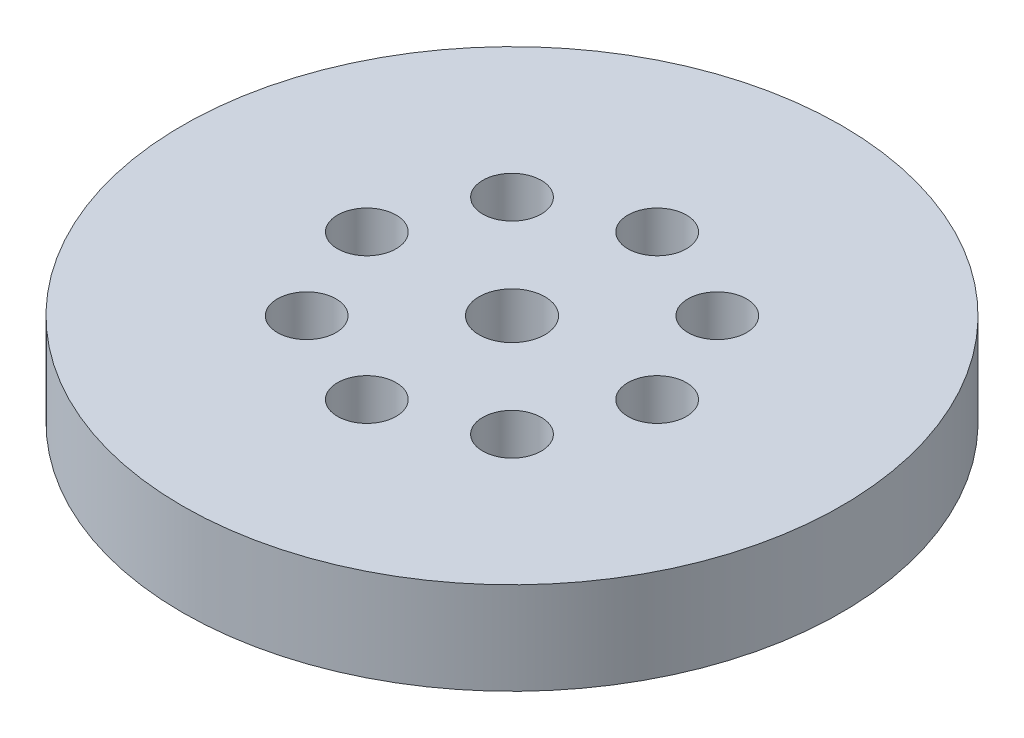
ISO-10303-21;
HEADER;
FILE_DESCRIPTION(('STEP AP214'),'2;1');
FILE_NAME('part.step','',(''),(''),'','','');
FILE_SCHEMA(('AUTOMOTIVE_DESIGN { 1 0 10303 214 1 1 1 1 }'));
ENDSEC;
DATA;
#1=APPLICATION_CONTEXT('core data for automotive mechanical design processes');
#2=APPLICATION_PROTOCOL_DEFINITION('international standard','automotive_design',2000,#1);
#3=PRODUCT_CONTEXT('',#1,'mechanical');
#4=PRODUCT('Part','Part','',(#3));
#5=PRODUCT_RELATED_PRODUCT_CATEGORY('part','',(#4));
#6=PRODUCT_DEFINITION_FORMATION('','',#4);
#7=PRODUCT_DEFINITION_CONTEXT('part definition',#1,'design');
#8=PRODUCT_DEFINITION('design','',#6,#7);
#9=PRODUCT_DEFINITION_SHAPE('','',#8);
#10=(LENGTH_UNIT() NAMED_UNIT(*) SI_UNIT(.MILLI.,.METRE.));
#11=(NAMED_UNIT(*) PLANE_ANGLE_UNIT() SI_UNIT($,.RADIAN.));
#12=(NAMED_UNIT(*) SI_UNIT($,.STERADIAN.) SOLID_ANGLE_UNIT());
#13=UNCERTAINTY_MEASURE_WITH_UNIT(LENGTH_MEASURE(1.E-05),#10,'distance_accuracy_value','');
#14=(GEOMETRIC_REPRESENTATION_CONTEXT(3) GLOBAL_UNCERTAINTY_ASSIGNED_CONTEXT((#13)) GLOBAL_UNIT_ASSIGNED_CONTEXT((#10,
#11,#12)) REPRESENTATION_CONTEXT('',''));
#15=CARTESIAN_POINT('',(0.,0.,0.));
#16=DIRECTION('',(0.,0.,1.));
#17=DIRECTION('',(1.,0.,0.));
#18=AXIS2_PLACEMENT_3D('',#15,#16,#17);
#19=CARTESIAN_POINT('',(0.,28.,0.));
#20=DIRECTION('',(0.,-1.,0.));
#21=DIRECTION('',(0.,0.,-1.));
#22=AXIS2_PLACEMENT_3D('',#19,#20,#21);
#23=CYLINDRICAL_SURFACE('',#22,100.);
#24=CARTESIAN_POINT('',(0.,28.,0.));
#25=DIRECTION('',(0.,1.,0.));
#26=DIRECTION('',(0.,0.,1.));
#27=AXIS2_PLACEMENT_3D('',#24,#25,#26);
#28=CIRCLE('',#27,100.);
#29=CARTESIAN_POINT('',(0.,28.,100.));
#30=VERTEX_POINT('',#29);
#31=EDGE_CURVE('E10',#30,#30,#28,.T.);
#32=ORIENTED_EDGE('',*,*,#31,.F.);
#33=EDGE_LOOP('',(#32));
#34=FACE_BOUND('',#33,.T.);
#35=CARTESIAN_POINT('',(0.,0.,0.));
#36=DIRECTION('',(0.,1.,0.));
#37=DIRECTION('',(0.,0.,1.));
#38=AXIS2_PLACEMENT_3D('',#35,#36,#37);
#39=CIRCLE('',#38,100.);
#40=CARTESIAN_POINT('',(0.,0.,100.));
#41=VERTEX_POINT('',#40);
#42=EDGE_CURVE('E37',#41,#41,#39,.T.);
#43=ORIENTED_EDGE('',*,*,#42,.T.);
#44=EDGE_LOOP('',(#43));
#45=FACE_BOUND('',#44,.T.);
#46=ADVANCED_FACE('F40',(#34,#45),#23,.T.);
#47=CARTESIAN_POINT('',(0.,28.,0.));
#48=DIRECTION('',(0.,1.,0.));
#49=DIRECTION('',(0.,0.,1.));
#50=AXIS2_PLACEMENT_3D('',#47,#48,#49);
#51=PLANE('',#50);
#52=CARTESIAN_POINT('',(1.53791106196484E-13,28.,44.0475234639062));
#53=DIRECTION('',(0.,1.,0.));
#54=DIRECTION('',(1.,0.,0.));
#55=AXIS2_PLACEMENT_3D('',#52,#53,#54);
#56=CIRCLE('',#55,8.8861157400528);
#57=CARTESIAN_POINT('',(8.88611574005295,28.,44.0475234639062));
#58=VERTEX_POINT('',#57);
#59=EDGE_CURVE('E88',#58,#58,#56,.T.);
#60=ORIENTED_EDGE('',*,*,#59,.F.);
#61=EDGE_LOOP('',(#60));
#62=FACE_BOUND('',#61,.T.);
#63=CARTESIAN_POINT('',(31.1463025358018,28.,31.1463025358015));
#64=DIRECTION('',(0.,1.,0.));
#65=DIRECTION('',(0.707106781186544,0.,-0.707106781186551));
#66=AXIS2_PLACEMENT_3D('',#63,#64,#65);
#67=CIRCLE('',#66,8.8861157400528);
#68=CARTESIAN_POINT('',(37.4297352340016,28.,24.8628698376016));
#69=VERTEX_POINT('',#68);
#70=EDGE_CURVE('E79',#69,#69,#67,.T.);
#71=ORIENTED_EDGE('',*,*,#70,.F.);
#72=EDGE_LOOP('',(#71));
#73=FACE_BOUND('',#72,.T.);
#74=CARTESIAN_POINT('',(44.0475234639062,28.,0.));
#75=DIRECTION('',(0.,1.,0.));
#76=DIRECTION('',(0.,0.,-1.));
#77=AXIS2_PLACEMENT_3D('',#74,#75,#76);
#78=CIRCLE('',#77,8.8861157400528);
#79=CARTESIAN_POINT('',(44.0475234639062,28.,-8.8861157400528));
#80=VERTEX_POINT('',#79);
#81=EDGE_CURVE('E74',#80,#80,#78,.T.);
#82=ORIENTED_EDGE('',*,*,#81,.F.);
#83=EDGE_LOOP('',(#82));
#84=FACE_BOUND('',#83,.T.);
#85=CARTESIAN_POINT('',(31.1463025358014,28.,-31.1463025358019));
#86=DIRECTION('',(0.,1.,0.));
#87=DIRECTION('',(-0.707106781186554,0.,-0.707106781186541));
#88=AXIS2_PLACEMENT_3D('',#85,#86,#87);
#89=CIRCLE('',#88,8.8861157400528);
#90=CARTESIAN_POINT('',(24.8628698376015,28.,-37.4297352340017));
#91=VERTEX_POINT('',#90);
#92=EDGE_CURVE('E70',#91,#91,#89,.T.);
#93=ORIENTED_EDGE('',*,*,#92,.F.);
#94=EDGE_LOOP('',(#93));
#95=FACE_BOUND('',#94,.T.);
#96=CARTESIAN_POINT('',(-4.61373318589451E-13,28.,-44.0475234639062));
#97=DIRECTION('',(0.,1.,0.));
#98=DIRECTION('',(-1.,0.,0.));
#99=AXIS2_PLACEMENT_3D('',#96,#97,#98);
#100=CIRCLE('',#99,8.8861157400528);
#101=CARTESIAN_POINT('',(-8.88611574005326,28.,-44.0475234639061));
#102=VERTEX_POINT('',#101);
#103=EDGE_CURVE('E100',#102,#102,#100,.T.);
#104=ORIENTED_EDGE('',*,*,#103,.F.);
#105=EDGE_LOOP('',(#104));
#106=FACE_BOUND('',#105,.T.);
#107=CARTESIAN_POINT('',(-31.146302535802,28.,-31.1463025358013));
#108=DIRECTION('',(0.,1.,0.));
#109=DIRECTION('',(-0.707106781186539,0.,0.707106781186556));
#110=AXIS2_PLACEMENT_3D('',#107,#108,#109);
#111=CIRCLE('',#110,8.8861157400528);
#112=CARTESIAN_POINT('',(-37.4297352340018,28.,-24.8628698376014));
#113=VERTEX_POINT('',#112);
#114=EDGE_CURVE('E93',#113,#113,#111,.T.);
#115=ORIENTED_EDGE('',*,*,#114,.F.);
#116=EDGE_LOOP('',(#115));
#117=FACE_BOUND('',#116,.T.);
#118=CARTESIAN_POINT('',(-31.1463025358016,28.,31.1463025358017));
#119=DIRECTION('',(0.,1.,0.));
#120=DIRECTION('',(0.707106781186549,0.,0.707106781186546));
#121=AXIS2_PLACEMENT_3D('',#118,#119,#120);
#122=CIRCLE('',#121,8.8861157400528);
#123=CARTESIAN_POINT('',(-24.8628698376017,28.,37.4297352340016));
#124=VERTEX_POINT('',#123);
#125=EDGE_CURVE('E61',#124,#124,#122,.T.);
#126=ORIENTED_EDGE('',*,*,#125,.F.);
#127=EDGE_LOOP('',(#126));
#128=FACE_BOUND('',#127,.T.);
#129=CARTESIAN_POINT('',(-44.0475234639062,28.,0.));
#130=DIRECTION('',(0.,1.,0.));
#131=DIRECTION('',(0.,0.,1.));
#132=AXIS2_PLACEMENT_3D('',#129,#130,#131);
#133=CIRCLE('',#132,8.8861157400528);
#134=CARTESIAN_POINT('',(-44.0475234639062,28.,8.8861157400528));
#135=VERTEX_POINT('',#134);
#136=EDGE_CURVE('E54',#135,#135,#133,.T.);
#137=ORIENTED_EDGE('',*,*,#136,.F.);
#138=EDGE_LOOP('',(#137));
#139=FACE_BOUND('',#138,.T.);
#140=CARTESIAN_POINT('',(0.,28.,0.));
#141=DIRECTION('',(0.,1.,0.));
#142=DIRECTION('',(0.,0.,1.));
#143=AXIS2_PLACEMENT_3D('',#140,#141,#142);
#144=CIRCLE('',#143,10.);
#145=CARTESIAN_POINT('',(0.,28.,10.));
#146=VERTEX_POINT('',#145);
#147=EDGE_CURVE('E50',#146,#146,#144,.T.);
#148=ORIENTED_EDGE('',*,*,#147,.F.);
#149=EDGE_LOOP('',(#148));
#150=FACE_BOUND('',#149,.T.);
#151=ORIENTED_EDGE('',*,*,#31,.T.);
#152=EDGE_LOOP('',(#151));
#153=FACE_BOUND('',#152,.T.);
#154=ADVANCED_FACE('F115',(#62,#73,#84,#95,#106,#117,#128,#139,#150,#153),#51,.T.);
#155=CARTESIAN_POINT('',(0.,0.,0.));
#156=DIRECTION('',(0.,1.,0.));
#157=DIRECTION('',(0.,0.,1.));
#158=AXIS2_PLACEMENT_3D('',#155,#156,#157);
#159=PLANE('',#158);
#160=CARTESIAN_POINT('',(0.,0.,0.));
#161=DIRECTION('',(0.,1.,0.));
#162=DIRECTION('',(0.,0.,1.));
#163=AXIS2_PLACEMENT_3D('',#160,#161,#162);
#164=CIRCLE('',#163,10.);
#165=CARTESIAN_POINT('',(0.,0.,10.));
#166=VERTEX_POINT('',#165);
#167=EDGE_CURVE('E47',#166,#166,#164,.T.);
#168=ORIENTED_EDGE('',*,*,#167,.T.);
#169=EDGE_LOOP('',(#168));
#170=FACE_BOUND('',#169,.T.);
#171=ORIENTED_EDGE('',*,*,#42,.F.);
#172=EDGE_LOOP('',(#171));
#173=FACE_BOUND('',#172,.T.);
#174=ADVANCED_FACE('F113',(#170,#173),#159,.F.);
#175=CARTESIAN_POINT('',(0.,28.,0.));
#176=DIRECTION('',(0.,-1.,0.));
#177=DIRECTION('',(0.,0.,-1.));
#178=AXIS2_PLACEMENT_3D('',#175,#176,#177);
#179=CYLINDRICAL_SURFACE('',#178,10.);
#180=ORIENTED_EDGE('',*,*,#147,.T.);
#181=EDGE_LOOP('',(#180));
#182=FACE_BOUND('',#181,.T.);
#183=ORIENTED_EDGE('',*,*,#167,.F.);
#184=EDGE_LOOP('',(#183));
#185=FACE_BOUND('',#184,.T.);
#186=ADVANCED_FACE('F127',(#182,#185),#179,.F.);
#187=CARTESIAN_POINT('',(-44.0475234639062,8.13748412467741,0.));
#188=DIRECTION('',(0.,1.,0.));
#189=DIRECTION('',(0.,0.,1.));
#190=AXIS2_PLACEMENT_3D('',#187,#188,#189);
#191=CYLINDRICAL_SURFACE('',#190,8.8861157400528);
#192=CARTESIAN_POINT('',(-44.0475234639062,8.13748412467741,0.));
#193=DIRECTION('',(0.,1.,0.));
#194=DIRECTION('',(0.,0.,1.));
#195=AXIS2_PLACEMENT_3D('',#192,#193,#194);
#196=CIRCLE('',#195,8.8861157400528);
#197=CARTESIAN_POINT('',(-44.0475234639062,8.13748412467741,8.8861157400528));
#198=VERTEX_POINT('',#197);
#199=EDGE_CURVE('E55',#198,#198,#196,.T.);
#200=ORIENTED_EDGE('',*,*,#199,.F.);
#201=EDGE_LOOP('',(#200));
#202=FACE_BOUND('',#201,.T.);
#203=ORIENTED_EDGE('',*,*,#136,.T.);
#204=EDGE_LOOP('',(#203));
#205=FACE_BOUND('',#204,.T.);
#206=ADVANCED_FACE('F129',(#202,#205),#191,.F.);
#207=CARTESIAN_POINT('',(-44.0475234639062,8.13748412467741,0.));
#208=DIRECTION('',(0.,1.,0.));
#209=DIRECTION('',(0.,0.,1.));
#210=AXIS2_PLACEMENT_3D('',#207,#208,#209);
#211=PLANE('',#210);
#212=ORIENTED_EDGE('',*,*,#199,.T.);
#213=EDGE_LOOP('',(#212));
#214=FACE_BOUND('',#213,.T.);
#215=ADVANCED_FACE('F157',(#214),#211,.T.);
#216=CARTESIAN_POINT('',(-31.1463025358016,8.13748412467741,31.1463025358017));
#217=DIRECTION('',(0.,1.,0.));
#218=DIRECTION('',(0.,0.,1.));
#219=AXIS2_PLACEMENT_3D('',#216,#217,#218);
#220=CYLINDRICAL_SURFACE('',#219,8.8861157400528);
#221=CARTESIAN_POINT('',(-31.1463025358016,8.13748412467741,31.1463025358017));
#222=DIRECTION('',(0.,1.,0.));
#223=DIRECTION('',(0.707106781186549,0.,0.707106781186546));
#224=AXIS2_PLACEMENT_3D('',#221,#222,#223);
#225=CIRCLE('',#224,8.8861157400528);
#226=CARTESIAN_POINT('',(-24.8628698376017,8.13748412467741,37.4297352340016));
#227=VERTEX_POINT('',#226);
#228=EDGE_CURVE('E59',#227,#227,#225,.T.);
#229=ORIENTED_EDGE('',*,*,#228,.F.);
#230=EDGE_LOOP('',(#229));
#231=FACE_BOUND('',#230,.T.);
#232=ORIENTED_EDGE('',*,*,#125,.T.);
#233=EDGE_LOOP('',(#232));
#234=FACE_BOUND('',#233,.T.);
#235=ADVANCED_FACE('F170',(#231,#234),#220,.F.);
#236=CARTESIAN_POINT('',(-31.1463025358016,8.13748412467741,31.1463025358017));
#237=DIRECTION('',(0.,1.,0.));
#238=DIRECTION('',(0.707106781186549,0.,0.707106781186546));
#239=AXIS2_PLACEMENT_3D('',#236,#237,#238);
#240=PLANE('',#239);
#241=ORIENTED_EDGE('',*,*,#228,.T.);
#242=EDGE_LOOP('',(#241));
#243=FACE_BOUND('',#242,.T.);
#244=ADVANCED_FACE('F182',(#243),#240,.T.);
#245=CARTESIAN_POINT('',(-31.146302535802,8.13748412467741,-31.1463025358013));
#246=DIRECTION('',(0.,1.,0.));
#247=DIRECTION('',(0.,0.,1.));
#248=AXIS2_PLACEMENT_3D('',#245,#246,#247);
#249=CYLINDRICAL_SURFACE('',#248,8.8861157400528);
#250=CARTESIAN_POINT('',(-31.146302535802,8.13748412467741,-31.1463025358013));
#251=DIRECTION('',(0.,1.,0.));
#252=DIRECTION('',(-0.707106781186539,0.,0.707106781186556));
#253=AXIS2_PLACEMENT_3D('',#250,#251,#252);
#254=CIRCLE('',#253,8.8861157400528);
#255=CARTESIAN_POINT('',(-37.4297352340018,8.13748412467741,-24.8628698376014));
#256=VERTEX_POINT('',#255);
#257=EDGE_CURVE('E94',#256,#256,#254,.T.);
#258=ORIENTED_EDGE('',*,*,#257,.F.);
#259=EDGE_LOOP('',(#258));
#260=FACE_BOUND('',#259,.T.);
#261=ORIENTED_EDGE('',*,*,#114,.T.);
#262=EDGE_LOOP('',(#261));
#263=FACE_BOUND('',#262,.T.);
#264=ADVANCED_FACE('F189',(#260,#263),#249,.F.);
#265=CARTESIAN_POINT('',(-31.146302535802,8.13748412467741,-31.1463025358013));
#266=DIRECTION('',(0.,1.,0.));
#267=DIRECTION('',(-0.707106781186539,0.,0.707106781186556));
#268=AXIS2_PLACEMENT_3D('',#265,#266,#267);
#269=PLANE('',#268);
#270=ORIENTED_EDGE('',*,*,#257,.T.);
#271=EDGE_LOOP('',(#270));
#272=FACE_BOUND('',#271,.T.);
#273=ADVANCED_FACE('F107',(#272),#269,.T.);
#274=CARTESIAN_POINT('',(-4.61373318589451E-13,8.13748412467741,-44.0475234639062));
#275=DIRECTION('',(0.,1.,0.));
#276=DIRECTION('',(0.,0.,1.));
#277=AXIS2_PLACEMENT_3D('',#274,#275,#276);
#278=CYLINDRICAL_SURFACE('',#277,8.8861157400528);
#279=CARTESIAN_POINT('',(-4.61373318589451E-13,8.13748412467741,-44.0475234639062));
#280=DIRECTION('',(0.,1.,0.));
#281=DIRECTION('',(-1.,0.,0.));
#282=AXIS2_PLACEMENT_3D('',#279,#280,#281);
#283=CIRCLE('',#282,8.8861157400528);
#284=CARTESIAN_POINT('',(-8.88611574005326,8.13748412467741,-44.0475234639061));
#285=VERTEX_POINT('',#284);
#286=EDGE_CURVE('E72',#285,#285,#283,.T.);
#287=ORIENTED_EDGE('',*,*,#286,.F.);
#288=EDGE_LOOP('',(#287));
#289=FACE_BOUND('',#288,.T.);
#290=ORIENTED_EDGE('',*,*,#103,.T.);
#291=EDGE_LOOP('',(#290));
#292=FACE_BOUND('',#291,.T.);
#293=ADVANCED_FACE('F104',(#289,#292),#278,.F.);
#294=CARTESIAN_POINT('',(-4.61373318589451E-13,8.13748412467741,-44.0475234639062));
#295=DIRECTION('',(0.,1.,0.));
#296=DIRECTION('',(-1.,0.,0.));
#297=AXIS2_PLACEMENT_3D('',#294,#295,#296);
#298=PLANE('',#297);
#299=ORIENTED_EDGE('',*,*,#286,.T.);
#300=EDGE_LOOP('',(#299));
#301=FACE_BOUND('',#300,.T.);
#302=ADVANCED_FACE('F103',(#301),#298,.T.);
#303=CARTESIAN_POINT('',(31.1463025358014,8.13748412467741,-31.1463025358019));
#304=DIRECTION('',(0.,1.,0.));
#305=DIRECTION('',(0.,0.,1.));
#306=AXIS2_PLACEMENT_3D('',#303,#304,#305);
#307=CYLINDRICAL_SURFACE('',#306,8.8861157400528);
#308=CARTESIAN_POINT('',(31.1463025358014,8.13748412467741,-31.1463025358019));
#309=DIRECTION('',(0.,1.,0.));
#310=DIRECTION('',(-0.707106781186554,0.,-0.707106781186541));
#311=AXIS2_PLACEMENT_3D('',#308,#309,#310);
#312=CIRCLE('',#311,8.8861157400528);
#313=CARTESIAN_POINT('',(24.8628698376015,8.13748412467741,-37.4297352340017));
#314=VERTEX_POINT('',#313);
#315=EDGE_CURVE('E69',#314,#314,#312,.T.);
#316=ORIENTED_EDGE('',*,*,#315,.F.);
#317=EDGE_LOOP('',(#316));
#318=FACE_BOUND('',#317,.T.);
#319=ORIENTED_EDGE('',*,*,#92,.T.);
#320=EDGE_LOOP('',(#319));
#321=FACE_BOUND('',#320,.T.);
#322=ADVANCED_FACE('F219',(#318,#321),#307,.F.);
#323=CARTESIAN_POINT('',(31.1463025358014,8.13748412467741,-31.1463025358019));
#324=DIRECTION('',(0.,1.,0.));
#325=DIRECTION('',(-0.707106781186554,0.,-0.707106781186541));
#326=AXIS2_PLACEMENT_3D('',#323,#324,#325);
#327=PLANE('',#326);
#328=ORIENTED_EDGE('',*,*,#315,.T.);
#329=EDGE_LOOP('',(#328));
#330=FACE_BOUND('',#329,.T.);
#331=ADVANCED_FACE('F227',(#330),#327,.T.);
#332=CARTESIAN_POINT('',(44.0475234639062,8.13748412467741,0.));
#333=DIRECTION('',(0.,1.,0.));
#334=DIRECTION('',(0.,0.,1.));
#335=AXIS2_PLACEMENT_3D('',#332,#333,#334);
#336=CYLINDRICAL_SURFACE('',#335,8.8861157400528);
#337=CARTESIAN_POINT('',(44.0475234639062,8.13748412467741,0.));
#338=DIRECTION('',(0.,1.,0.));
#339=DIRECTION('',(0.,0.,-1.));
#340=AXIS2_PLACEMENT_3D('',#337,#338,#339);
#341=CIRCLE('',#340,8.8861157400528);
#342=CARTESIAN_POINT('',(44.0475234639062,8.13748412467741,-8.8861157400528));
#343=VERTEX_POINT('',#342);
#344=EDGE_CURVE('E80',#343,#343,#341,.T.);
#345=ORIENTED_EDGE('',*,*,#344,.F.);
#346=EDGE_LOOP('',(#345));
#347=FACE_BOUND('',#346,.T.);
#348=ORIENTED_EDGE('',*,*,#81,.T.);
#349=EDGE_LOOP('',(#348));
#350=FACE_BOUND('',#349,.T.);
#351=ADVANCED_FACE('F240',(#347,#350),#336,.F.);
#352=CARTESIAN_POINT('',(44.0475234639062,8.13748412467741,0.));
#353=DIRECTION('',(0.,1.,0.));
#354=DIRECTION('',(0.,0.,-1.));
#355=AXIS2_PLACEMENT_3D('',#352,#353,#354);
#356=PLANE('',#355);
#357=ORIENTED_EDGE('',*,*,#344,.T.);
#358=EDGE_LOOP('',(#357));
#359=FACE_BOUND('',#358,.T.);
#360=ADVANCED_FACE('F246',(#359),#356,.T.);
#361=CARTESIAN_POINT('',(31.1463025358018,8.13748412467741,31.1463025358015));
#362=DIRECTION('',(0.,1.,0.));
#363=DIRECTION('',(0.,0.,1.));
#364=AXIS2_PLACEMENT_3D('',#361,#362,#363);
#365=CYLINDRICAL_SURFACE('',#364,8.8861157400528);
#366=CARTESIAN_POINT('',(31.1463025358018,8.13748412467741,31.1463025358015));
#367=DIRECTION('',(0.,1.,0.));
#368=DIRECTION('',(0.707106781186544,0.,-0.707106781186551));
#369=AXIS2_PLACEMENT_3D('',#366,#367,#368);
#370=CIRCLE('',#369,8.8861157400528);
#371=CARTESIAN_POINT('',(37.4297352340016,8.13748412467741,24.8628698376016));
#372=VERTEX_POINT('',#371);
#373=EDGE_CURVE('E82',#372,#372,#370,.T.);
#374=ORIENTED_EDGE('',*,*,#373,.F.);
#375=EDGE_LOOP('',(#374));
#376=FACE_BOUND('',#375,.T.);
#377=ORIENTED_EDGE('',*,*,#70,.T.);
#378=EDGE_LOOP('',(#377));
#379=FACE_BOUND('',#378,.T.);
#380=ADVANCED_FACE('F254',(#376,#379),#365,.F.);
#381=CARTESIAN_POINT('',(31.1463025358018,8.13748412467741,31.1463025358015));
#382=DIRECTION('',(0.,1.,0.));
#383=DIRECTION('',(0.707106781186544,0.,-0.707106781186551));
#384=AXIS2_PLACEMENT_3D('',#381,#382,#383);
#385=PLANE('',#384);
#386=ORIENTED_EDGE('',*,*,#373,.T.);
#387=EDGE_LOOP('',(#386));
#388=FACE_BOUND('',#387,.T.);
#389=ADVANCED_FACE('F262',(#388),#385,.T.);
#390=CARTESIAN_POINT('',(1.53791106196484E-13,8.13748412467741,44.0475234639062));
#391=DIRECTION('',(0.,1.,0.));
#392=DIRECTION('',(0.,0.,1.));
#393=AXIS2_PLACEMENT_3D('',#390,#391,#392);
#394=CYLINDRICAL_SURFACE('',#393,8.8861157400528);
#395=CARTESIAN_POINT('',(1.53791106196484E-13,8.13748412467741,44.0475234639062));
#396=DIRECTION('',(0.,1.,0.));
#397=DIRECTION('',(1.,0.,0.));
#398=AXIS2_PLACEMENT_3D('',#395,#396,#397);
#399=CIRCLE('',#398,8.8861157400528);
#400=CARTESIAN_POINT('',(8.88611574005295,8.13748412467741,44.0475234639062));
#401=VERTEX_POINT('',#400);
#402=EDGE_CURVE('E63',#401,#401,#399,.T.);
#403=ORIENTED_EDGE('',*,*,#402,.F.);
#404=EDGE_LOOP('',(#403));
#405=FACE_BOUND('',#404,.T.);
#406=ORIENTED_EDGE('',*,*,#59,.T.);
#407=EDGE_LOOP('',(#406));
#408=FACE_BOUND('',#407,.T.);
#409=ADVANCED_FACE('F272',(#405,#408),#394,.F.);
#410=CARTESIAN_POINT('',(1.53791106196484E-13,8.13748412467741,44.0475234639062));
#411=DIRECTION('',(0.,1.,0.));
#412=DIRECTION('',(1.,0.,0.));
#413=AXIS2_PLACEMENT_3D('',#410,#411,#412);
#414=PLANE('',#413);
#415=ORIENTED_EDGE('',*,*,#402,.T.);
#416=EDGE_LOOP('',(#415));
#417=FACE_BOUND('',#416,.T.);
#418=ADVANCED_FACE('F285',(#417),#414,.T.);
#419=CLOSED_SHELL('',(#46,#154,#174,#186,#206,#215,#235,#244,#264,#273,#293,#302,#322,#331,#351,
#360,#380,#389,#409,#418));
#420=MANIFOLD_SOLID_BREP('B2',#419);
#421=ADVANCED_BREP_SHAPE_REPRESENTATION('',(#18,#420),#14);
#422=SHAPE_DEFINITION_REPRESENTATION(#9,#421);
ENDSEC;
END-ISO-10303-21;
